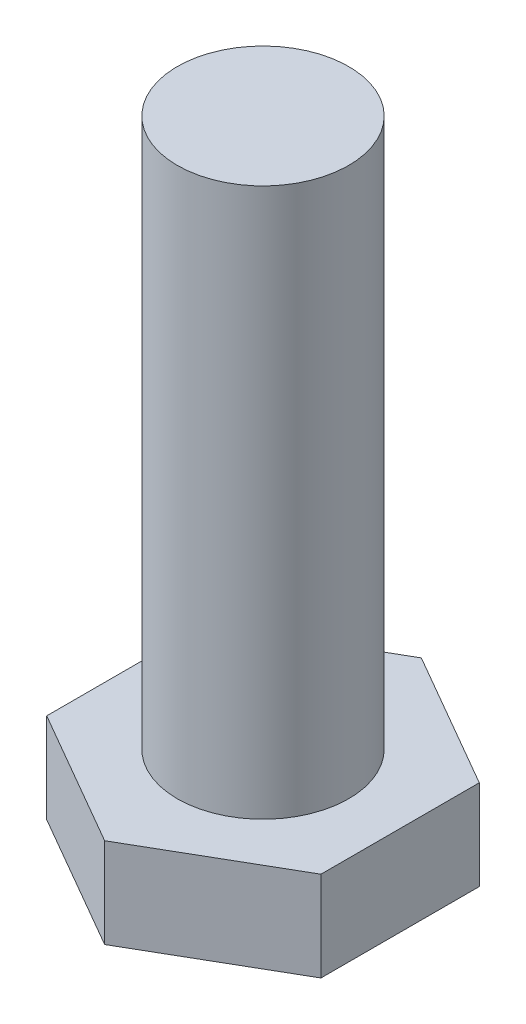
ISO-10303-21;
HEADER;
FILE_DESCRIPTION(('STEP AP214'),'2;1');
FILE_NAME('part.step','',(''),(''),'','','');
FILE_SCHEMA(('AUTOMOTIVE_DESIGN { 1 0 10303 214 1 1 1 1 }'));
ENDSEC;
DATA;
#1=APPLICATION_CONTEXT('core data for automotive mechanical design processes');
#2=APPLICATION_PROTOCOL_DEFINITION('international standard','automotive_design',2000,#1);
#3=PRODUCT_CONTEXT('',#1,'mechanical');
#4=PRODUCT('Part','Part','',(#3));
#5=PRODUCT_RELATED_PRODUCT_CATEGORY('part','',(#4));
#6=PRODUCT_DEFINITION_FORMATION('','',#4);
#7=PRODUCT_DEFINITION_CONTEXT('part definition',#1,'design');
#8=PRODUCT_DEFINITION('design','',#6,#7);
#9=PRODUCT_DEFINITION_SHAPE('','',#8);
#10=(LENGTH_UNIT() NAMED_UNIT(*) SI_UNIT(.MILLI.,.METRE.));
#11=(NAMED_UNIT(*) PLANE_ANGLE_UNIT() SI_UNIT($,.RADIAN.));
#12=(NAMED_UNIT(*) SI_UNIT($,.STERADIAN.) SOLID_ANGLE_UNIT());
#13=UNCERTAINTY_MEASURE_WITH_UNIT(LENGTH_MEASURE(1.E-05),#10,'distance_accuracy_value','');
#14=(GEOMETRIC_REPRESENTATION_CONTEXT(3) GLOBAL_UNCERTAINTY_ASSIGNED_CONTEXT((#13)) GLOBAL_UNIT_ASSIGNED_CONTEXT((#10,
#11,#12)) REPRESENTATION_CONTEXT('',''));
#15=CARTESIAN_POINT('',(0.,0.,0.));
#16=DIRECTION('',(0.,0.,1.));
#17=DIRECTION('',(1.,0.,0.));
#18=AXIS2_PLACEMENT_3D('',#15,#16,#17);
#19=CARTESIAN_POINT('',(0.,3.2,0.));
#20=DIRECTION('',(0.,1.,0.));
#21=DIRECTION('',(0.,0.,1.));
#22=AXIS2_PLACEMENT_3D('',#19,#20,#21);
#23=PLANE('',#22);
#24=DIRECTION('',(0.866025403784439,0.,-0.5));
#25=VECTOR('',#24,1.);
#26=CARTESIAN_POINT('',(0.,3.2,4.61880215351701));
#27=LINE('',#26,#25);
#28=CARTESIAN_POINT('',(0.,3.2,4.61880215351701));
#29=VERTEX_POINT('',#28);
#30=CARTESIAN_POINT('',(4.,3.2,2.3094010767585));
#31=VERTEX_POINT('',#30);
#32=EDGE_CURVE('E118',#29,#31,#27,.T.);
#33=ORIENTED_EDGE('',*,*,#32,.T.);
#34=DIRECTION('',(0.,0.,-1.));
#35=VECTOR('',#34,1.);
#36=CARTESIAN_POINT('',(4.,3.2,2.3094010767585));
#37=LINE('',#36,#35);
#38=CARTESIAN_POINT('',(4.,3.2,-2.3094010767585));
#39=VERTEX_POINT('',#38);
#40=EDGE_CURVE('E107',#31,#39,#37,.T.);
#41=ORIENTED_EDGE('',*,*,#40,.T.);
#42=DIRECTION('',(-0.866025403784439,0.,-0.5));
#43=VECTOR('',#42,1.);
#44=CARTESIAN_POINT('',(4.,3.2,-2.3094010767585));
#45=LINE('',#44,#43);
#46=CARTESIAN_POINT('',(0.,3.2,-4.61880215351701));
#47=VERTEX_POINT('',#46);
#48=EDGE_CURVE('E117',#39,#47,#45,.T.);
#49=ORIENTED_EDGE('',*,*,#48,.T.);
#50=DIRECTION('',(-0.866025403784438,0.,0.5));
#51=VECTOR('',#50,1.);
#52=CARTESIAN_POINT('',(0.,3.2,-4.61880215351701));
#53=LINE('',#52,#51);
#54=CARTESIAN_POINT('',(-4.,3.2,-2.3094010767585));
#55=VERTEX_POINT('',#54);
#56=EDGE_CURVE('E186',#47,#55,#53,.T.);
#57=ORIENTED_EDGE('',*,*,#56,.T.);
#58=DIRECTION('',(0.,0.,1.));
#59=VECTOR('',#58,1.);
#60=CARTESIAN_POINT('',(-4.,3.2,-2.3094010767585));
#61=LINE('',#60,#59);
#62=CARTESIAN_POINT('',(-4.,3.2,2.3094010767585));
#63=VERTEX_POINT('',#62);
#64=EDGE_CURVE('E188',#55,#63,#61,.T.);
#65=ORIENTED_EDGE('',*,*,#64,.T.);
#66=DIRECTION('',(0.866025403784439,0.,0.5));
#67=VECTOR('',#66,1.);
#68=CARTESIAN_POINT('',(-4.,3.2,2.3094010767585));
#69=LINE('',#68,#67);
#70=EDGE_CURVE('E123',#63,#29,#69,.T.);
#71=ORIENTED_EDGE('',*,*,#70,.T.);
#72=EDGE_LOOP('',(#33,#41,#49,#57,#65,#71));
#73=FACE_BOUND('',#72,.T.);
#74=CARTESIAN_POINT('',(0.,3.2,0.));
#75=DIRECTION('',(0.,1.,0.));
#76=DIRECTION('',(0.,0.,1.));
#77=AXIS2_PLACEMENT_3D('',#74,#75,#76);
#78=CIRCLE('',#77,2.5);
#79=CARTESIAN_POINT('',(0.,3.2,2.5));
#80=VERTEX_POINT('',#79);
#81=EDGE_CURVE('E174',#80,#80,#78,.T.);
#82=ORIENTED_EDGE('',*,*,#81,.F.);
#83=EDGE_LOOP('',(#82));
#84=FACE_BOUND('',#83,.T.);
#85=ADVANCED_FACE('F34',(#73,#84),#23,.T.);
#86=CARTESIAN_POINT('',(0.,3.2,4.61880215351701));
#87=DIRECTION('',(-0.5,0.,-0.866025403784439));
#88=DIRECTION('',(-0.866025403784439,0.,0.5));
#89=AXIS2_PLACEMENT_3D('',#86,#87,#88);
#90=PLANE('',#89);
#91=DIRECTION('',(0.,-1.,0.));
#92=VECTOR('',#91,1.);
#93=CARTESIAN_POINT('',(0.,3.2,4.61880215351701));
#94=LINE('',#93,#92);
#95=CARTESIAN_POINT('',(0.,0.577350269189627,4.61880215351701));
#96=VERTEX_POINT('',#95);
#97=EDGE_CURVE('E191',#29,#96,#94,.T.);
#98=ORIENTED_EDGE('',*,*,#97,.T.);
#99=DIRECTION('',(0.866025403784439,0.,-0.5));
#100=VECTOR('',#99,1.);
#101=CARTESIAN_POINT('',(0.,0.577350269189626,4.61880215351701));
#102=LINE('',#101,#100);
#103=CARTESIAN_POINT('',(4.,0.577350269189626,2.3094010767585));
#104=VERTEX_POINT('',#103);
#105=EDGE_CURVE('E131',#96,#104,#102,.T.);
#106=ORIENTED_EDGE('',*,*,#105,.T.);
#107=DIRECTION('',(0.,-1.,0.));
#108=VECTOR('',#107,1.);
#109=CARTESIAN_POINT('',(4.,3.2,2.3094010767585));
#110=LINE('',#109,#108);
#111=EDGE_CURVE('E111',#31,#104,#110,.T.);
#112=ORIENTED_EDGE('',*,*,#111,.F.);
#113=ORIENTED_EDGE('',*,*,#32,.F.);
#114=EDGE_LOOP('',(#98,#106,#112,#113));
#115=FACE_BOUND('',#114,.T.);
#116=ADVANCED_FACE('F129',(#115),#90,.F.);
#117=CARTESIAN_POINT('',(4.,3.2,2.3094010767585));
#118=DIRECTION('',(-1.,0.,0.));
#119=DIRECTION('',(0.,0.,1.));
#120=AXIS2_PLACEMENT_3D('',#117,#118,#119);
#121=PLANE('',#120);
#122=ORIENTED_EDGE('',*,*,#111,.T.);
#123=DIRECTION('',(0.,0.,-1.));
#124=VECTOR('',#123,1.);
#125=CARTESIAN_POINT('',(4.,0.577350269189626,2.3094010767585));
#126=LINE('',#125,#124);
#127=CARTESIAN_POINT('',(4.,0.577350269189626,-2.3094010767585));
#128=VERTEX_POINT('',#127);
#129=EDGE_CURVE('E153',#104,#128,#126,.T.);
#130=ORIENTED_EDGE('',*,*,#129,.T.);
#131=DIRECTION('',(0.,-1.,0.));
#132=VECTOR('',#131,1.);
#133=CARTESIAN_POINT('',(4.,3.2,-2.3094010767585));
#134=LINE('',#133,#132);
#135=EDGE_CURVE('E114',#39,#128,#134,.T.);
#136=ORIENTED_EDGE('',*,*,#135,.F.);
#137=ORIENTED_EDGE('',*,*,#40,.F.);
#138=EDGE_LOOP('',(#122,#130,#136,#137));
#139=FACE_BOUND('',#138,.T.);
#140=ADVANCED_FACE('F109',(#139),#121,.F.);
#141=CARTESIAN_POINT('',(4.,3.2,-2.3094010767585));
#142=DIRECTION('',(-0.5,0.,0.866025403784439));
#143=DIRECTION('',(0.866025403784439,0.,0.5));
#144=AXIS2_PLACEMENT_3D('',#141,#142,#143);
#145=PLANE('',#144);
#146=ORIENTED_EDGE('',*,*,#135,.T.);
#147=DIRECTION('',(-0.866025403784439,0.,-0.5));
#148=VECTOR('',#147,1.);
#149=CARTESIAN_POINT('',(4.,0.577350269189626,-2.3094010767585));
#150=LINE('',#149,#148);
#151=CARTESIAN_POINT('',(0.,0.577350269189626,-4.61880215351701));
#152=VERTEX_POINT('',#151);
#153=EDGE_CURVE('E132',#128,#152,#150,.T.);
#154=ORIENTED_EDGE('',*,*,#153,.T.);
#155=DIRECTION('',(0.,-1.,0.));
#156=VECTOR('',#155,1.);
#157=CARTESIAN_POINT('',(0.,3.2,-4.61880215351701));
#158=LINE('',#157,#156);
#159=EDGE_CURVE('E137',#47,#152,#158,.T.);
#160=ORIENTED_EDGE('',*,*,#159,.F.);
#161=ORIENTED_EDGE('',*,*,#48,.F.);
#162=EDGE_LOOP('',(#146,#154,#160,#161));
#163=FACE_BOUND('',#162,.T.);
#164=ADVANCED_FACE('F200',(#163),#145,.F.);
#165=CARTESIAN_POINT('',(0.,3.2,-4.61880215351701));
#166=DIRECTION('',(0.5,0.,0.866025403784438));
#167=DIRECTION('',(0.866025403784439,0.,-0.5));
#168=AXIS2_PLACEMENT_3D('',#165,#166,#167);
#169=PLANE('',#168);
#170=ORIENTED_EDGE('',*,*,#159,.T.);
#171=DIRECTION('',(-0.866025403784439,0.,0.5));
#172=VECTOR('',#171,1.);
#173=CARTESIAN_POINT('',(0.,0.577350269189626,-4.61880215351701));
#174=LINE('',#173,#172);
#175=CARTESIAN_POINT('',(-4.,0.577350269189626,-2.3094010767585));
#176=VERTEX_POINT('',#175);
#177=EDGE_CURVE('E11',#152,#176,#174,.T.);
#178=ORIENTED_EDGE('',*,*,#177,.T.);
#179=DIRECTION('',(0.,-1.,0.));
#180=VECTOR('',#179,1.);
#181=CARTESIAN_POINT('',(-4.,3.2,-2.3094010767585));
#182=LINE('',#181,#180);
#183=EDGE_CURVE('E195',#55,#176,#182,.T.);
#184=ORIENTED_EDGE('',*,*,#183,.F.);
#185=ORIENTED_EDGE('',*,*,#56,.F.);
#186=EDGE_LOOP('',(#170,#178,#184,#185));
#187=FACE_BOUND('',#186,.T.);
#188=ADVANCED_FACE('F198',(#187),#169,.F.);
#189=CARTESIAN_POINT('',(-4.,3.2,-2.3094010767585));
#190=DIRECTION('',(1.,0.,0.));
#191=DIRECTION('',(0.,0.,-1.));
#192=AXIS2_PLACEMENT_3D('',#189,#190,#191);
#193=PLANE('',#192);
#194=ORIENTED_EDGE('',*,*,#183,.T.);
#195=DIRECTION('',(0.,0.,1.));
#196=VECTOR('',#195,1.);
#197=CARTESIAN_POINT('',(-4.,0.577350269189626,-2.3094010767585));
#198=LINE('',#197,#196);
#199=CARTESIAN_POINT('',(-4.,0.577350269189626,2.3094010767585));
#200=VERTEX_POINT('',#199);
#201=EDGE_CURVE('E43',#176,#200,#198,.T.);
#202=ORIENTED_EDGE('',*,*,#201,.T.);
#203=DIRECTION('',(0.,-1.,0.));
#204=VECTOR('',#203,1.);
#205=CARTESIAN_POINT('',(-4.,3.2,2.3094010767585));
#206=LINE('',#205,#204);
#207=EDGE_CURVE('E193',#63,#200,#206,.T.);
#208=ORIENTED_EDGE('',*,*,#207,.F.);
#209=ORIENTED_EDGE('',*,*,#64,.F.);
#210=EDGE_LOOP('',(#194,#202,#208,#209));
#211=FACE_BOUND('',#210,.T.);
#212=ADVANCED_FACE('F221',(#211),#193,.F.);
#213=CARTESIAN_POINT('',(-4.,3.2,2.3094010767585));
#214=DIRECTION('',(0.5,0.,-0.866025403784439));
#215=DIRECTION('',(-0.866025403784439,0.,-0.5));
#216=AXIS2_PLACEMENT_3D('',#213,#214,#215);
#217=PLANE('',#216);
#218=ORIENTED_EDGE('',*,*,#207,.T.);
#219=DIRECTION('',(0.866025403784439,0.,0.5));
#220=VECTOR('',#219,1.);
#221=CARTESIAN_POINT('',(-4.,0.577350269189627,2.3094010767585));
#222=LINE('',#221,#220);
#223=EDGE_CURVE('E156',#200,#96,#222,.T.);
#224=ORIENTED_EDGE('',*,*,#223,.T.);
#225=ORIENTED_EDGE('',*,*,#97,.F.);
#226=ORIENTED_EDGE('',*,*,#70,.F.);
#227=EDGE_LOOP('',(#218,#224,#225,#226));
#228=FACE_BOUND('',#227,.T.);
#229=ADVANCED_FACE('F219',(#228),#217,.F.);
#230=CARTESIAN_POINT('',(0.,0.,0.));
#231=DIRECTION('',(0.,1.,0.));
#232=DIRECTION('',(0.,0.,1.));
#233=AXIS2_PLACEMENT_3D('',#230,#231,#232);
#234=PLANE('',#233);
#235=DIRECTION('',(0.866025403784439,0.,-0.5));
#236=VECTOR('',#235,1.);
#237=CARTESIAN_POINT('',(-1.5,0.,-2.59807621135331));
#238=LINE('',#237,#236);
#239=CARTESIAN_POINT('',(-3.,0.,-1.73205080756887));
#240=VERTEX_POINT('',#239);
#241=CARTESIAN_POINT('',(0.,0.,-3.46410161513775));
#242=VERTEX_POINT('',#241);
#243=EDGE_CURVE('E135',#240,#242,#238,.T.);
#244=ORIENTED_EDGE('',*,*,#243,.T.);
#245=DIRECTION('',(0.866025403784439,0.,0.5));
#246=VECTOR('',#245,1.);
#247=CARTESIAN_POINT('',(1.5,0.,-2.59807621135331));
#248=LINE('',#247,#246);
#249=CARTESIAN_POINT('',(2.99999999999999,0.,-1.73205080756887));
#250=VERTEX_POINT('',#249);
#251=EDGE_CURVE('E150',#242,#250,#248,.T.);
#252=ORIENTED_EDGE('',*,*,#251,.T.);
#253=DIRECTION('',(0.,0.,1.));
#254=VECTOR('',#253,1.);
#255=CARTESIAN_POINT('',(3.,0.,0.));
#256=LINE('',#255,#254);
#257=CARTESIAN_POINT('',(3.,0.,1.73205080756887));
#258=VERTEX_POINT('',#257);
#259=EDGE_CURVE('E148',#250,#258,#256,.T.);
#260=ORIENTED_EDGE('',*,*,#259,.T.);
#261=DIRECTION('',(-0.866025403784439,0.,0.5));
#262=VECTOR('',#261,1.);
#263=CARTESIAN_POINT('',(1.5,0.,2.59807621135331));
#264=LINE('',#263,#262);
#265=CARTESIAN_POINT('',(0.,0.,3.46410161513775));
#266=VERTEX_POINT('',#265);
#267=EDGE_CURVE('E146',#258,#266,#264,.T.);
#268=ORIENTED_EDGE('',*,*,#267,.T.);
#269=DIRECTION('',(-0.866025403784439,0.,-0.5));
#270=VECTOR('',#269,1.);
#271=CARTESIAN_POINT('',(-1.5,0.,2.59807621135331));
#272=LINE('',#271,#270);
#273=CARTESIAN_POINT('',(-3.,0.,1.73205080756887));
#274=VERTEX_POINT('',#273);
#275=EDGE_CURVE('E144',#266,#274,#272,.T.);
#276=ORIENTED_EDGE('',*,*,#275,.T.);
#277=DIRECTION('',(0.,0.,-1.));
#278=VECTOR('',#277,1.);
#279=CARTESIAN_POINT('',(-3.,0.,0.));
#280=LINE('',#279,#278);
#281=EDGE_CURVE('E142',#274,#240,#280,.T.);
#282=ORIENTED_EDGE('',*,*,#281,.T.);
#283=EDGE_LOOP('',(#244,#252,#260,#268,#276,#282));
#284=FACE_BOUND('',#283,.T.);
#285=ADVANCED_FACE('F214',(#284),#234,.F.);
#286=CARTESIAN_POINT('',(0.,19.2,0.));
#287=DIRECTION('',(0.,-1.,0.));
#288=DIRECTION('',(0.,0.,-1.));
#289=AXIS2_PLACEMENT_3D('',#286,#287,#288);
#290=CYLINDRICAL_SURFACE('',#289,2.5);
#291=CARTESIAN_POINT('',(0.,19.2,0.));
#292=DIRECTION('',(0.,1.,0.));
#293=DIRECTION('',(0.,0.,1.));
#294=AXIS2_PLACEMENT_3D('',#291,#292,#293);
#295=CIRCLE('',#294,2.5);
#296=CARTESIAN_POINT('',(0.,19.2,2.5));
#297=VERTEX_POINT('',#296);
#298=EDGE_CURVE('E127',#297,#297,#295,.T.);
#299=ORIENTED_EDGE('',*,*,#298,.F.);
#300=EDGE_LOOP('',(#299));
#301=FACE_BOUND('',#300,.T.);
#302=ORIENTED_EDGE('',*,*,#81,.T.);
#303=EDGE_LOOP('',(#302));
#304=FACE_BOUND('',#303,.T.);
#305=ADVANCED_FACE('F238',(#301,#304),#290,.T.);
#306=CARTESIAN_POINT('',(0.,19.2,0.));
#307=DIRECTION('',(0.,1.,0.));
#308=DIRECTION('',(0.,0.,1.));
#309=AXIS2_PLACEMENT_3D('',#306,#307,#308);
#310=PLANE('',#309);
#311=ORIENTED_EDGE('',*,*,#298,.T.);
#312=EDGE_LOOP('',(#311));
#313=FACE_BOUND('',#312,.T.);
#314=ADVANCED_FACE('F244',(#313),#310,.T.);
#315=CARTESIAN_POINT('',(-4.,0.577350269189626,2.3094010767585));
#316=DIRECTION('',(0.249999999999999,0.866025403784439,-0.433012701892218));
#317=DIRECTION('',(0.866025403784439,0.,0.5));
#318=AXIS2_PLACEMENT_3D('',#315,#316,#317);
#319=PLANE('',#318);
#320=DIRECTION('',(-0.774596669241484,0.447213595499957,0.447213595499959));
#321=VECTOR('',#320,1.);
#322=CARTESIAN_POINT('',(-2.4,-0.346410161513774,1.3856406460551));
#323=LINE('',#322,#321);
#324=EDGE_CURVE('E168',#274,#200,#323,.T.);
#325=ORIENTED_EDGE('',*,*,#324,.F.);
#326=ORIENTED_EDGE('',*,*,#275,.F.);
#327=DIRECTION('',(0.,0.447213595499956,0.894427190999917));
#328=VECTOR('',#327,1.);
#329=CARTESIAN_POINT('',(0.,-0.346410161513774,2.7712812921102));
#330=LINE('',#329,#328);
#331=EDGE_CURVE('E38',#96,#266,#330,.F.);
#332=ORIENTED_EDGE('',*,*,#331,.F.);
#333=ORIENTED_EDGE('',*,*,#223,.F.);
#334=EDGE_LOOP('',(#325,#326,#332,#333));
#335=FACE_BOUND('',#334,.T.);
#336=ADVANCED_FACE('F36',(#335),#319,.F.);
#337=CARTESIAN_POINT('',(0.,0.577350269189626,4.61880215351701));
#338=DIRECTION('',(-0.249999999999999,0.86602540378444,-0.433012701892218));
#339=DIRECTION('',(0.866025403784439,0.,-0.5));
#340=AXIS2_PLACEMENT_3D('',#337,#338,#339);
#341=PLANE('',#340);
#342=ORIENTED_EDGE('',*,*,#331,.T.);
#343=ORIENTED_EDGE('',*,*,#267,.F.);
#344=DIRECTION('',(0.774596669241484,0.447213595499956,0.447213595499959));
#345=VECTOR('',#344,1.);
#346=CARTESIAN_POINT('',(2.4,-0.346410161513773,1.3856406460551));
#347=LINE('',#346,#345);
#348=EDGE_CURVE('E166',#104,#258,#347,.F.);
#349=ORIENTED_EDGE('',*,*,#348,.F.);
#350=ORIENTED_EDGE('',*,*,#105,.F.);
#351=EDGE_LOOP('',(#342,#343,#349,#350));
#352=FACE_BOUND('',#351,.T.);
#353=ADVANCED_FACE('F254',(#352),#341,.F.);
#354=CARTESIAN_POINT('',(-4.,0.577350269189626,-2.3094010767585));
#355=DIRECTION('',(0.499999999999999,0.866025403784439,0.));
#356=DIRECTION('',(0.,0.,1.));
#357=AXIS2_PLACEMENT_3D('',#354,#355,#356);
#358=PLANE('',#357);
#359=ORIENTED_EDGE('',*,*,#324,.T.);
#360=ORIENTED_EDGE('',*,*,#201,.F.);
#361=DIRECTION('',(-0.774596669241484,0.447213595499957,-0.447213595499959));
#362=VECTOR('',#361,1.);
#363=CARTESIAN_POINT('',(-2.4,-0.346410161513772,-1.3856406460551));
#364=LINE('',#363,#362);
#365=EDGE_CURVE('E163',#240,#176,#364,.T.);
#366=ORIENTED_EDGE('',*,*,#365,.F.);
#367=ORIENTED_EDGE('',*,*,#281,.F.);
#368=EDGE_LOOP('',(#359,#360,#366,#367));
#369=FACE_BOUND('',#368,.T.);
#370=ADVANCED_FACE('F212',(#369),#358,.F.);
#371=CARTESIAN_POINT('',(4.,0.577350269189626,2.3094010767585));
#372=DIRECTION('',(-0.499999999999998,0.866025403784439,0.));
#373=DIRECTION('',(0.,0.,-1.));
#374=AXIS2_PLACEMENT_3D('',#371,#372,#373);
#375=PLANE('',#374);
#376=ORIENTED_EDGE('',*,*,#348,.T.);
#377=ORIENTED_EDGE('',*,*,#259,.F.);
#378=DIRECTION('',(0.774596669241484,0.447213595499957,-0.447213595499958));
#379=VECTOR('',#378,1.);
#380=CARTESIAN_POINT('',(2.4,-0.346410161513772,-1.3856406460551));
#381=LINE('',#380,#379);
#382=EDGE_CURVE('E161',#128,#250,#381,.F.);
#383=ORIENTED_EDGE('',*,*,#382,.F.);
#384=ORIENTED_EDGE('',*,*,#129,.F.);
#385=EDGE_LOOP('',(#376,#377,#383,#384));
#386=FACE_BOUND('',#385,.T.);
#387=ADVANCED_FACE('F261',(#386),#375,.F.);
#388=CARTESIAN_POINT('',(0.,0.577350269189626,-4.61880215351701));
#389=DIRECTION('',(0.249999999999999,0.866025403784439,0.433012701892218));
#390=DIRECTION('',(-0.866025403784439,0.,0.5));
#391=AXIS2_PLACEMENT_3D('',#388,#389,#390);
#392=PLANE('',#391);
#393=ORIENTED_EDGE('',*,*,#365,.T.);
#394=ORIENTED_EDGE('',*,*,#177,.F.);
#395=DIRECTION('',(0.,-0.447213595499957,0.894427190999917));
#396=VECTOR('',#395,1.);
#397=CARTESIAN_POINT('',(0.,0.577350269189626,-4.61880215351701));
#398=LINE('',#397,#396);
#399=EDGE_CURVE('E159',#242,#152,#398,.F.);
#400=ORIENTED_EDGE('',*,*,#399,.F.);
#401=ORIENTED_EDGE('',*,*,#243,.F.);
#402=EDGE_LOOP('',(#393,#394,#400,#401));
#403=FACE_BOUND('',#402,.T.);
#404=ADVANCED_FACE('F210',(#403),#392,.F.);
#405=CARTESIAN_POINT('',(4.,0.577350269189626,-2.3094010767585));
#406=DIRECTION('',(-0.249999999999999,0.866025403784439,0.433012701892218));
#407=DIRECTION('',(-0.866025403784439,0.,-0.5));
#408=AXIS2_PLACEMENT_3D('',#405,#406,#407);
#409=PLANE('',#408);
#410=ORIENTED_EDGE('',*,*,#382,.T.);
#411=ORIENTED_EDGE('',*,*,#251,.F.);
#412=ORIENTED_EDGE('',*,*,#399,.T.);
#413=ORIENTED_EDGE('',*,*,#153,.F.);
#414=EDGE_LOOP('',(#410,#411,#412,#413));
#415=FACE_BOUND('',#414,.T.);
#416=ADVANCED_FACE('F204',(#415),#409,.F.);
#417=CLOSED_SHELL('',(#85,#116,#140,#164,#188,#212,#229,#285,#305,#314,#336,#353,#370,#387,#404,#416));
#418=MANIFOLD_SOLID_BREP('B2',#417);
#419=ADVANCED_BREP_SHAPE_REPRESENTATION('',(#18,#418),#14);
#420=SHAPE_DEFINITION_REPRESENTATION(#9,#419);
ENDSEC;
END-ISO-10303-21;
